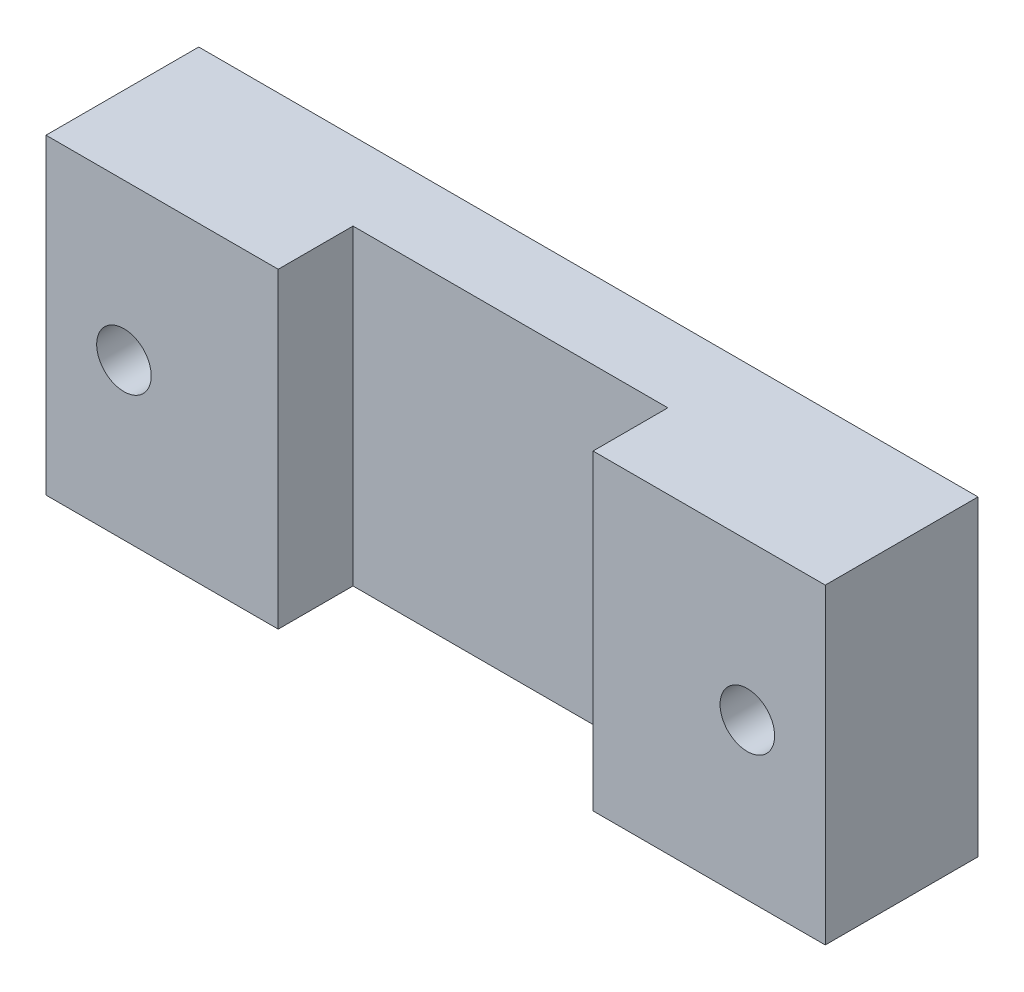
ISO-10303-21;
HEADER;
FILE_DESCRIPTION(('STEP AP214'),'2;1');
FILE_NAME('part.step','',(''),(''),'','','');
FILE_SCHEMA(('AUTOMOTIVE_DESIGN { 1 0 10303 214 1 1 1 1 }'));
ENDSEC;
DATA;
#1=APPLICATION_CONTEXT('core data for automotive mechanical design processes');
#2=APPLICATION_PROTOCOL_DEFINITION('international standard','automotive_design',2000,#1);
#3=PRODUCT_CONTEXT('',#1,'mechanical');
#4=PRODUCT('Part','Part','',(#3));
#5=PRODUCT_RELATED_PRODUCT_CATEGORY('part','',(#4));
#6=PRODUCT_DEFINITION_FORMATION('','',#4);
#7=PRODUCT_DEFINITION_CONTEXT('part definition',#1,'design');
#8=PRODUCT_DEFINITION('design','',#6,#7);
#9=PRODUCT_DEFINITION_SHAPE('','',#8);
#10=(LENGTH_UNIT() NAMED_UNIT(*) SI_UNIT(.MILLI.,.METRE.));
#11=(NAMED_UNIT(*) PLANE_ANGLE_UNIT() SI_UNIT($,.RADIAN.));
#12=(NAMED_UNIT(*) SI_UNIT($,.STERADIAN.) SOLID_ANGLE_UNIT());
#13=UNCERTAINTY_MEASURE_WITH_UNIT(LENGTH_MEASURE(1.E-05),#10,'distance_accuracy_value','');
#14=(GEOMETRIC_REPRESENTATION_CONTEXT(3) GLOBAL_UNCERTAINTY_ASSIGNED_CONTEXT((#13)) GLOBAL_UNIT_ASSIGNED_CONTEXT((#10,
#11,#12)) REPRESENTATION_CONTEXT('',''));
#15=CARTESIAN_POINT('',(0.,0.,0.));
#16=DIRECTION('',(0.,0.,1.));
#17=DIRECTION('',(1.,0.,0.));
#18=AXIS2_PLACEMENT_3D('',#15,#16,#17);
#19=CARTESIAN_POINT('',(0.,0.,5.));
#20=DIRECTION('',(0.,0.,1.));
#21=DIRECTION('',(1.,0.,0.));
#22=AXIS2_PLACEMENT_3D('',#19,#20,#21);
#23=PLANE('',#22);
#24=DIRECTION('',(0.,-1.,0.));
#25=VECTOR('',#24,1.);
#26=CARTESIAN_POINT('',(-10.1,60.951349344252,5.));
#27=LINE('',#26,#25);
#28=CARTESIAN_POINT('',(-10.1,10.,5.));
#29=VERTEX_POINT('',#28);
#30=CARTESIAN_POINT('',(-10.1,-9.99999999999999,5.));
#31=VERTEX_POINT('',#30);
#32=EDGE_CURVE('E54',#29,#31,#27,.T.);
#33=ORIENTED_EDGE('',*,*,#32,.T.);
#34=DIRECTION('',(1.,0.,0.));
#35=VECTOR('',#34,1.);
#36=CARTESIAN_POINT('',(25.,-9.99999999999999,5.));
#37=LINE('',#36,#35);
#38=CARTESIAN_POINT('',(10.1,-9.99999999999999,5.));
#39=VERTEX_POINT('',#38);
#40=EDGE_CURVE('E49',#31,#39,#37,.T.);
#41=ORIENTED_EDGE('',*,*,#40,.T.);
#42=DIRECTION('',(0.,-1.,0.));
#43=VECTOR('',#42,1.);
#44=CARTESIAN_POINT('',(10.1,60.951349344252,5.));
#45=LINE('',#44,#43);
#46=CARTESIAN_POINT('',(10.1,10.,5.));
#47=VERTEX_POINT('',#46);
#48=EDGE_CURVE('E142',#47,#39,#45,.T.);
#49=ORIENTED_EDGE('',*,*,#48,.F.);
#50=DIRECTION('',(-1.,0.,0.));
#51=VECTOR('',#50,1.);
#52=CARTESIAN_POINT('',(25.,10.,5.));
#53=LINE('',#52,#51);
#54=EDGE_CURVE('E153',#47,#29,#53,.T.);
#55=ORIENTED_EDGE('',*,*,#54,.T.);
#56=EDGE_LOOP('',(#33,#41,#49,#55));
#57=FACE_BOUND('',#56,.T.);
#58=ADVANCED_FACE('F34',(#57),#23,.T.);
#59=CARTESIAN_POINT('',(0.,0.,0.));
#60=DIRECTION('',(0.,0.,1.));
#61=DIRECTION('',(1.,0.,0.));
#62=AXIS2_PLACEMENT_3D('',#59,#60,#61);
#63=PLANE('',#62);
#64=DIRECTION('',(0.,-1.,0.));
#65=VECTOR('',#64,1.);
#66=CARTESIAN_POINT('',(-25.,-9.99999999999999,0.));
#67=LINE('',#66,#65);
#68=CARTESIAN_POINT('',(-25.,10.,0.));
#69=VERTEX_POINT('',#68);
#70=CARTESIAN_POINT('',(-25.,-9.99999999999999,0.));
#71=VERTEX_POINT('',#70);
#72=EDGE_CURVE('E151',#69,#71,#67,.T.);
#73=ORIENTED_EDGE('',*,*,#72,.F.);
#74=DIRECTION('',(-1.,0.,0.));
#75=VECTOR('',#74,1.);
#76=CARTESIAN_POINT('',(25.,10.,0.));
#77=LINE('',#76,#75);
#78=CARTESIAN_POINT('',(25.,10.,0.));
#79=VERTEX_POINT('',#78);
#80=EDGE_CURVE('E154',#79,#69,#77,.T.);
#81=ORIENTED_EDGE('',*,*,#80,.F.);
#82=DIRECTION('',(0.,1.,0.));
#83=VECTOR('',#82,1.);
#84=CARTESIAN_POINT('',(25.,-9.99999999999999,0.));
#85=LINE('',#84,#83);
#86=CARTESIAN_POINT('',(25.,-9.99999999999999,0.));
#87=VERTEX_POINT('',#86);
#88=EDGE_CURVE('E160',#87,#79,#85,.T.);
#89=ORIENTED_EDGE('',*,*,#88,.F.);
#90=DIRECTION('',(1.,0.,0.));
#91=VECTOR('',#90,1.);
#92=CARTESIAN_POINT('',(25.,-9.99999999999999,0.));
#93=LINE('',#92,#91);
#94=EDGE_CURVE('E102',#71,#87,#93,.T.);
#95=ORIENTED_EDGE('',*,*,#94,.F.);
#96=EDGE_LOOP('',(#73,#81,#89,#95));
#97=FACE_BOUND('',#96,.T.);
#98=CARTESIAN_POINT('',(-20.,0.,0.));
#99=DIRECTION('',(0.,0.,1.));
#100=DIRECTION('',(1.,0.,0.));
#101=AXIS2_PLACEMENT_3D('',#98,#99,#100);
#102=CIRCLE('',#101,1.75);
#103=CARTESIAN_POINT('',(-18.25,0.,0.));
#104=VERTEX_POINT('',#103);
#105=EDGE_CURVE('E148',#104,#104,#102,.T.);
#106=ORIENTED_EDGE('',*,*,#105,.T.);
#107=EDGE_LOOP('',(#106));
#108=FACE_BOUND('',#107,.T.);
#109=CARTESIAN_POINT('',(20.,0.,0.));
#110=DIRECTION('',(0.,0.,1.));
#111=DIRECTION('',(1.,0.,0.));
#112=AXIS2_PLACEMENT_3D('',#109,#110,#111);
#113=CIRCLE('',#112,1.75);
#114=CARTESIAN_POINT('',(21.75,0.,0.));
#115=VERTEX_POINT('',#114);
#116=EDGE_CURVE('E145',#115,#115,#113,.T.);
#117=ORIENTED_EDGE('',*,*,#116,.T.);
#118=EDGE_LOOP('',(#117));
#119=FACE_BOUND('',#118,.T.);
#120=ADVANCED_FACE('F170',(#97,#108,#119),#63,.F.);
#121=CARTESIAN_POINT('',(-25.,-9.99999999999999,5.));
#122=DIRECTION('',(1.,0.,0.));
#123=DIRECTION('',(0.,1.,0.));
#124=AXIS2_PLACEMENT_3D('',#121,#122,#123);
#125=PLANE('',#124);
#126=ORIENTED_EDGE('',*,*,#72,.T.);
#127=DIRECTION('',(0.,0.,-1.));
#128=VECTOR('',#127,1.);
#129=CARTESIAN_POINT('',(-25.,-9.99999999999999,5.));
#130=LINE('',#129,#128);
#131=CARTESIAN_POINT('',(-25.,-9.99999999999999,9.8));
#132=VERTEX_POINT('',#131);
#133=EDGE_CURVE('E11',#132,#71,#130,.T.);
#134=ORIENTED_EDGE('',*,*,#133,.F.);
#135=DIRECTION('',(0.,-1.,0.));
#136=VECTOR('',#135,1.);
#137=CARTESIAN_POINT('',(-25.,60.951349344252,9.8));
#138=LINE('',#137,#136);
#139=CARTESIAN_POINT('',(-25.,10.,9.8));
#140=VERTEX_POINT('',#139);
#141=EDGE_CURVE('E135',#140,#132,#138,.T.);
#142=ORIENTED_EDGE('',*,*,#141,.F.);
#143=DIRECTION('',(0.,0.,-1.));
#144=VECTOR('',#143,1.);
#145=CARTESIAN_POINT('',(-25.,10.,5.));
#146=LINE('',#145,#144);
#147=EDGE_CURVE('E156',#140,#69,#146,.T.);
#148=ORIENTED_EDGE('',*,*,#147,.T.);
#149=EDGE_LOOP('',(#126,#134,#142,#148));
#150=FACE_BOUND('',#149,.T.);
#151=ADVANCED_FACE('F36',(#150),#125,.F.);
#152=CARTESIAN_POINT('',(25.,-9.99999999999999,5.));
#153=DIRECTION('',(0.,1.,0.));
#154=DIRECTION('',(-1.,0.,0.));
#155=AXIS2_PLACEMENT_3D('',#152,#153,#154);
#156=PLANE('',#155);
#157=ORIENTED_EDGE('',*,*,#94,.T.);
#158=DIRECTION('',(0.,0.,-1.));
#159=VECTOR('',#158,1.);
#160=CARTESIAN_POINT('',(25.,-9.99999999999999,5.));
#161=LINE('',#160,#159);
#162=CARTESIAN_POINT('',(25.,-9.99999999999999,9.8));
#163=VERTEX_POINT('',#162);
#164=EDGE_CURVE('E42',#163,#87,#161,.T.);
#165=ORIENTED_EDGE('',*,*,#164,.F.);
#166=DIRECTION('',(-1.,0.,0.));
#167=VECTOR('',#166,1.);
#168=CARTESIAN_POINT('',(10.1,-9.99999999999999,9.8));
#169=LINE('',#168,#167);
#170=CARTESIAN_POINT('',(10.1,-9.99999999999999,9.8));
#171=VERTEX_POINT('',#170);
#172=EDGE_CURVE('E101',#163,#171,#169,.T.);
#173=ORIENTED_EDGE('',*,*,#172,.T.);
#174=DIRECTION('',(0.,0.,-1.));
#175=VECTOR('',#174,1.);
#176=CARTESIAN_POINT('',(10.1,-9.99999999999999,5.));
#177=LINE('',#176,#175);
#178=EDGE_CURVE('E119',#171,#39,#177,.T.);
#179=ORIENTED_EDGE('',*,*,#178,.T.);
#180=ORIENTED_EDGE('',*,*,#40,.F.);
#181=DIRECTION('',(0.,0.,1.));
#182=VECTOR('',#181,1.);
#183=CARTESIAN_POINT('',(-10.1,-9.99999999999999,9.8));
#184=LINE('',#183,#182);
#185=CARTESIAN_POINT('',(-10.1,-9.99999999999999,9.8));
#186=VERTEX_POINT('',#185);
#187=EDGE_CURVE('E122',#31,#186,#184,.T.);
#188=ORIENTED_EDGE('',*,*,#187,.T.);
#189=DIRECTION('',(-1.,0.,0.));
#190=VECTOR('',#189,1.);
#191=CARTESIAN_POINT('',(-25.,-9.99999999999999,9.8));
#192=LINE('',#191,#190);
#193=EDGE_CURVE('E114',#186,#132,#192,.T.);
#194=ORIENTED_EDGE('',*,*,#193,.T.);
#195=ORIENTED_EDGE('',*,*,#133,.T.);
#196=EDGE_LOOP('',(#157,#165,#173,#179,#180,#188,#194,#195));
#197=FACE_BOUND('',#196,.T.);
#198=ADVANCED_FACE('F98',(#197),#156,.F.);
#199=CARTESIAN_POINT('',(25.,-9.99999999999999,5.));
#200=DIRECTION('',(-1.,0.,0.));
#201=DIRECTION('',(0.,-1.,0.));
#202=AXIS2_PLACEMENT_3D('',#199,#200,#201);
#203=PLANE('',#202);
#204=ORIENTED_EDGE('',*,*,#88,.T.);
#205=DIRECTION('',(0.,0.,-1.));
#206=VECTOR('',#205,1.);
#207=CARTESIAN_POINT('',(25.,10.,5.));
#208=LINE('',#207,#206);
#209=CARTESIAN_POINT('',(25.,10.,9.8));
#210=VERTEX_POINT('',#209);
#211=EDGE_CURVE('E105',#210,#79,#208,.T.);
#212=ORIENTED_EDGE('',*,*,#211,.F.);
#213=DIRECTION('',(0.,-1.,0.));
#214=VECTOR('',#213,1.);
#215=CARTESIAN_POINT('',(25.,60.951349344252,9.8));
#216=LINE('',#215,#214);
#217=EDGE_CURVE('E107',#210,#163,#216,.T.);
#218=ORIENTED_EDGE('',*,*,#217,.T.);
#219=ORIENTED_EDGE('',*,*,#164,.T.);
#220=EDGE_LOOP('',(#204,#212,#218,#219));
#221=FACE_BOUND('',#220,.T.);
#222=ADVANCED_FACE('F108',(#221),#203,.F.);
#223=CARTESIAN_POINT('',(25.,10.,5.));
#224=DIRECTION('',(0.,-1.,0.));
#225=DIRECTION('',(1.,0.,0.));
#226=AXIS2_PLACEMENT_3D('',#223,#224,#225);
#227=PLANE('',#226);
#228=ORIENTED_EDGE('',*,*,#80,.T.);
#229=ORIENTED_EDGE('',*,*,#147,.F.);
#230=DIRECTION('',(1.,0.,0.));
#231=VECTOR('',#230,1.);
#232=CARTESIAN_POINT('',(-25.,10.,9.8));
#233=LINE('',#232,#231);
#234=CARTESIAN_POINT('',(-10.1,10.,9.8));
#235=VERTEX_POINT('',#234);
#236=EDGE_CURVE('E128',#140,#235,#233,.T.);
#237=ORIENTED_EDGE('',*,*,#236,.T.);
#238=DIRECTION('',(0.,0.,-1.));
#239=VECTOR('',#238,1.);
#240=CARTESIAN_POINT('',(-10.1,10.,9.8));
#241=LINE('',#240,#239);
#242=EDGE_CURVE('E181',#235,#29,#241,.T.);
#243=ORIENTED_EDGE('',*,*,#242,.T.);
#244=ORIENTED_EDGE('',*,*,#54,.F.);
#245=DIRECTION('',(0.,0.,1.));
#246=VECTOR('',#245,1.);
#247=CARTESIAN_POINT('',(10.1,10.,5.));
#248=LINE('',#247,#246);
#249=CARTESIAN_POINT('',(10.1,10.,9.8));
#250=VERTEX_POINT('',#249);
#251=EDGE_CURVE('E182',#47,#250,#248,.T.);
#252=ORIENTED_EDGE('',*,*,#251,.T.);
#253=DIRECTION('',(1.,0.,0.));
#254=VECTOR('',#253,1.);
#255=CARTESIAN_POINT('',(10.1,10.,9.8));
#256=LINE('',#255,#254);
#257=EDGE_CURVE('E138',#250,#210,#256,.T.);
#258=ORIENTED_EDGE('',*,*,#257,.T.);
#259=ORIENTED_EDGE('',*,*,#211,.T.);
#260=EDGE_LOOP('',(#228,#229,#237,#243,#244,#252,#258,#259));
#261=FACE_BOUND('',#260,.T.);
#262=ADVANCED_FACE('F167',(#261),#227,.F.);
#263=CARTESIAN_POINT('',(-20.,0.,5.));
#264=DIRECTION('',(0.,0.,-1.));
#265=DIRECTION('',(-1.,0.,0.));
#266=AXIS2_PLACEMENT_3D('',#263,#264,#265);
#267=CYLINDRICAL_SURFACE('',#266,1.75);
#268=ORIENTED_EDGE('',*,*,#105,.F.);
#269=EDGE_LOOP('',(#268));
#270=FACE_BOUND('',#269,.T.);
#271=CARTESIAN_POINT('',(-20.,0.,9.8));
#272=DIRECTION('',(0.,0.,-1.));
#273=DIRECTION('',(-1.,0.,0.));
#274=AXIS2_PLACEMENT_3D('',#271,#272,#273);
#275=CIRCLE('',#274,1.75);
#276=CARTESIAN_POINT('',(-21.75,0.,9.8));
#277=VERTEX_POINT('',#276);
#278=EDGE_CURVE('E120',#277,#277,#275,.T.);
#279=ORIENTED_EDGE('',*,*,#278,.F.);
#280=EDGE_LOOP('',(#279));
#281=FACE_BOUND('',#280,.T.);
#282=ADVANCED_FACE('F193',(#270,#281),#267,.F.);
#283=CARTESIAN_POINT('',(20.,0.,5.));
#284=DIRECTION('',(0.,0.,-1.));
#285=DIRECTION('',(-1.,0.,0.));
#286=AXIS2_PLACEMENT_3D('',#283,#284,#285);
#287=CYLINDRICAL_SURFACE('',#286,1.75);
#288=ORIENTED_EDGE('',*,*,#116,.F.);
#289=EDGE_LOOP('',(#288));
#290=FACE_BOUND('',#289,.T.);
#291=CARTESIAN_POINT('',(20.,0.,9.8));
#292=DIRECTION('',(0.,0.,-1.));
#293=DIRECTION('',(-1.,0.,0.));
#294=AXIS2_PLACEMENT_3D('',#291,#292,#293);
#295=CIRCLE('',#294,1.75);
#296=CARTESIAN_POINT('',(18.25,0.,9.8));
#297=VERTEX_POINT('',#296);
#298=EDGE_CURVE('E125',#297,#297,#295,.T.);
#299=ORIENTED_EDGE('',*,*,#298,.F.);
#300=EDGE_LOOP('',(#299));
#301=FACE_BOUND('',#300,.T.);
#302=ADVANCED_FACE('F191',(#290,#301),#287,.F.);
#303=CARTESIAN_POINT('',(10.1,60.951349344252,9.8));
#304=DIRECTION('',(0.,0.,1.));
#305=DIRECTION('',(1.,0.,0.));
#306=AXIS2_PLACEMENT_3D('',#303,#304,#305);
#307=PLANE('',#306);
#308=ORIENTED_EDGE('',*,*,#298,.T.);
#309=EDGE_LOOP('',(#308));
#310=FACE_BOUND('',#309,.T.);
#311=ORIENTED_EDGE('',*,*,#257,.F.);
#312=DIRECTION('',(0.,-1.,0.));
#313=VECTOR('',#312,1.);
#314=CARTESIAN_POINT('',(10.1,60.951349344252,9.8));
#315=LINE('',#314,#313);
#316=EDGE_CURVE('E113',#250,#171,#315,.T.);
#317=ORIENTED_EDGE('',*,*,#316,.T.);
#318=ORIENTED_EDGE('',*,*,#172,.F.);
#319=ORIENTED_EDGE('',*,*,#217,.F.);
#320=EDGE_LOOP('',(#311,#317,#318,#319));
#321=FACE_BOUND('',#320,.T.);
#322=ADVANCED_FACE('F116',(#310,#321),#307,.T.);
#323=CARTESIAN_POINT('',(10.1,60.951349344252,5.));
#324=DIRECTION('',(-1.,0.,0.));
#325=DIRECTION('',(0.,0.,1.));
#326=AXIS2_PLACEMENT_3D('',#323,#324,#325);
#327=PLANE('',#326);
#328=ORIENTED_EDGE('',*,*,#251,.F.);
#329=ORIENTED_EDGE('',*,*,#48,.T.);
#330=ORIENTED_EDGE('',*,*,#178,.F.);
#331=ORIENTED_EDGE('',*,*,#316,.F.);
#332=EDGE_LOOP('',(#328,#329,#330,#331));
#333=FACE_BOUND('',#332,.T.);
#334=ADVANCED_FACE('F200',(#333),#327,.T.);
#335=CARTESIAN_POINT('',(-25.,60.951349344252,9.8));
#336=DIRECTION('',(0.,0.,1.));
#337=DIRECTION('',(1.,0.,0.));
#338=AXIS2_PLACEMENT_3D('',#335,#336,#337);
#339=PLANE('',#338);
#340=ORIENTED_EDGE('',*,*,#278,.T.);
#341=EDGE_LOOP('',(#340));
#342=FACE_BOUND('',#341,.T.);
#343=ORIENTED_EDGE('',*,*,#236,.F.);
#344=ORIENTED_EDGE('',*,*,#141,.T.);
#345=ORIENTED_EDGE('',*,*,#193,.F.);
#346=DIRECTION('',(0.,-1.,0.));
#347=VECTOR('',#346,1.);
#348=CARTESIAN_POINT('',(-10.1,60.951349344252,9.8));
#349=LINE('',#348,#347);
#350=EDGE_CURVE('E139',#235,#186,#349,.T.);
#351=ORIENTED_EDGE('',*,*,#350,.F.);
#352=EDGE_LOOP('',(#343,#344,#345,#351));
#353=FACE_BOUND('',#352,.T.);
#354=ADVANCED_FACE('F179',(#342,#353),#339,.T.);
#355=CARTESIAN_POINT('',(-10.1,60.951349344252,9.8));
#356=DIRECTION('',(1.,0.,0.));
#357=DIRECTION('',(0.,0.,-1.));
#358=AXIS2_PLACEMENT_3D('',#355,#356,#357);
#359=PLANE('',#358);
#360=ORIENTED_EDGE('',*,*,#242,.F.);
#361=ORIENTED_EDGE('',*,*,#350,.T.);
#362=ORIENTED_EDGE('',*,*,#187,.F.);
#363=ORIENTED_EDGE('',*,*,#32,.F.);
#364=EDGE_LOOP('',(#360,#361,#362,#363));
#365=FACE_BOUND('',#364,.T.);
#366=ADVANCED_FACE('F287',(#365),#359,.T.);
#367=CLOSED_SHELL('',(#58,#120,#151,#198,#222,#262,#282,#302,#322,#334,#354,#366));
#368=MANIFOLD_SOLID_BREP('B2',#367);
#369=ADVANCED_BREP_SHAPE_REPRESENTATION('',(#18,#368),#14);
#370=SHAPE_DEFINITION_REPRESENTATION(#9,#369);
ENDSEC;
END-ISO-10303-21;
